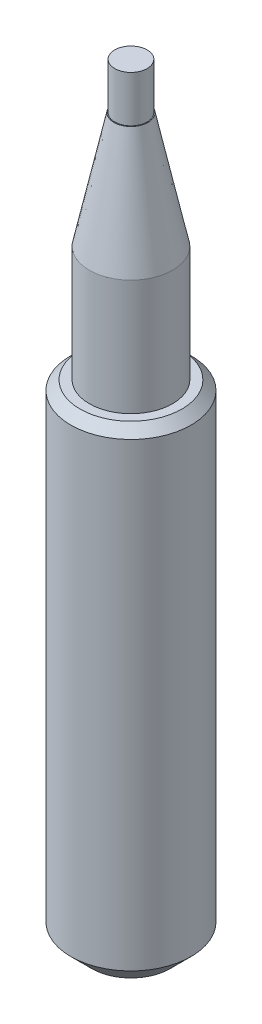
ISO-10303-21;
HEADER;
FILE_DESCRIPTION(('STEP AP214'),'2;1');
FILE_NAME('part.step','',(''),(''),'','','');
FILE_SCHEMA(('AUTOMOTIVE_DESIGN { 1 0 10303 214 1 1 1 1 }'));
ENDSEC;
DATA;
#1=APPLICATION_CONTEXT('core data for automotive mechanical design processes');
#2=APPLICATION_PROTOCOL_DEFINITION('international standard','automotive_design',2000,#1);
#3=PRODUCT_CONTEXT('',#1,'mechanical');
#4=PRODUCT('Part','Part','',(#3));
#5=PRODUCT_RELATED_PRODUCT_CATEGORY('part','',(#4));
#6=PRODUCT_DEFINITION_FORMATION('','',#4);
#7=PRODUCT_DEFINITION_CONTEXT('part definition',#1,'design');
#8=PRODUCT_DEFINITION('design','',#6,#7);
#9=PRODUCT_DEFINITION_SHAPE('','',#8);
#10=(LENGTH_UNIT() NAMED_UNIT(*) SI_UNIT(.MILLI.,.METRE.));
#11=(NAMED_UNIT(*) PLANE_ANGLE_UNIT() SI_UNIT($,.RADIAN.));
#12=(NAMED_UNIT(*) SI_UNIT($,.STERADIAN.) SOLID_ANGLE_UNIT());
#13=UNCERTAINTY_MEASURE_WITH_UNIT(LENGTH_MEASURE(1.E-05),#10,'distance_accuracy_value','');
#14=(GEOMETRIC_REPRESENTATION_CONTEXT(3) GLOBAL_UNCERTAINTY_ASSIGNED_CONTEXT((#13)) GLOBAL_UNIT_ASSIGNED_CONTEXT((#10,
#11,#12)) REPRESENTATION_CONTEXT('',''));
#15=CARTESIAN_POINT('',(0.,0.,0.));
#16=DIRECTION('',(0.,0.,1.));
#17=DIRECTION('',(1.,0.,0.));
#18=AXIS2_PLACEMENT_3D('',#15,#16,#17);
#19=CARTESIAN_POINT('',(0.,50.,0.));
#20=DIRECTION('',(0.,-1.,0.));
#21=DIRECTION('',(0.,0.,-1.));
#22=AXIS2_PLACEMENT_3D('',#19,#20,#21);
#23=CYLINDRICAL_SURFACE('',#22,9.);
#24=CARTESIAN_POINT('',(0.,24.9999999999998,0.));
#25=DIRECTION('',(0.,1.,0.));
#26=DIRECTION('',(0.,0.,1.));
#27=AXIS2_PLACEMENT_3D('',#24,#25,#26);
#28=CIRCLE('',#27,9.);
#29=CARTESIAN_POINT('',(0.,24.9999999999998,9.));
#30=VERTEX_POINT('',#29);
#31=EDGE_CURVE('E55',#30,#30,#28,.F.);
#32=ORIENTED_EDGE('',*,*,#31,.T.);
#33=EDGE_LOOP('',(#32));
#34=FACE_BOUND('',#33,.T.);
#35=CARTESIAN_POINT('',(0.,0.,0.));
#36=DIRECTION('',(0.,1.,0.));
#37=DIRECTION('',(0.,0.,1.));
#38=AXIS2_PLACEMENT_3D('',#35,#36,#37);
#39=CIRCLE('',#38,9.);
#40=CARTESIAN_POINT('',(0.,0.,9.));
#41=VERTEX_POINT('',#40);
#42=EDGE_CURVE('E155',#41,#41,#39,.T.);
#43=ORIENTED_EDGE('',*,*,#42,.T.);
#44=EDGE_LOOP('',(#43));
#45=FACE_BOUND('',#44,.T.);
#46=ADVANCED_FACE('F43',(#34,#45),#23,.T.);
#47=CARTESIAN_POINT('',(0.,50.,0.));
#48=DIRECTION('',(0.,1.,0.));
#49=DIRECTION('',(0.,0.,1.));
#50=AXIS2_PLACEMENT_3D('',#47,#48,#49);
#51=PLANE('',#50);
#52=CARTESIAN_POINT('',(0.,50.,0.));
#53=DIRECTION('',(0.,1.,0.));
#54=DIRECTION('',(0.,0.,1.));
#55=AXIS2_PLACEMENT_3D('',#52,#53,#54);
#56=CIRCLE('',#55,3.6860859582495);
#57=CARTESIAN_POINT('',(0.,50.,3.6860859582495));
#58=VERTEX_POINT('',#57);
#59=EDGE_CURVE('E59',#58,#58,#56,.T.);
#60=ORIENTED_EDGE('',*,*,#59,.T.);
#61=EDGE_LOOP('',(#60));
#62=FACE_BOUND('',#61,.T.);
#63=CARTESIAN_POINT('',(0.,50.,0.));
#64=DIRECTION('',(0.,1.,0.));
#65=DIRECTION('',(0.,0.,1.));
#66=AXIS2_PLACEMENT_3D('',#63,#64,#65);
#67=CIRCLE('',#66,3.5);
#68=CARTESIAN_POINT('',(0.,50.,3.5));
#69=VERTEX_POINT('',#68);
#70=EDGE_CURVE('E157',#69,#69,#67,.T.);
#71=ORIENTED_EDGE('',*,*,#70,.F.);
#72=EDGE_LOOP('',(#71));
#73=FACE_BOUND('',#72,.T.);
#74=ADVANCED_FACE('F144',(#62,#73),#51,.T.);
#75=CARTESIAN_POINT('',(0.,-106.,0.));
#76=DIRECTION('',(0.,1.,0.));
#77=DIRECTION('',(0.,0.,1.));
#78=AXIS2_PLACEMENT_3D('',#75,#76,#77);
#79=CYLINDRICAL_SURFACE('',#78,13.);
#80=CARTESIAN_POINT('',(0.,-1.99999999999999,0.));
#81=DIRECTION('',(0.,1.,0.));
#82=DIRECTION('',(0.,0.,1.));
#83=AXIS2_PLACEMENT_3D('',#80,#81,#82);
#84=CIRCLE('',#83,13.);
#85=CARTESIAN_POINT('',(0.,-1.99999999999999,13.));
#86=VERTEX_POINT('',#85);
#87=EDGE_CURVE('E10',#86,#86,#84,.F.);
#88=ORIENTED_EDGE('',*,*,#87,.T.);
#89=EDGE_LOOP('',(#88));
#90=FACE_BOUND('',#89,.T.);
#91=CARTESIAN_POINT('',(0.,-101.5,0.));
#92=DIRECTION('',(0.,1.,0.));
#93=DIRECTION('',(0.,0.,1.));
#94=AXIS2_PLACEMENT_3D('',#91,#92,#93);
#95=CIRCLE('',#94,13.);
#96=CARTESIAN_POINT('',(0.,-101.5,13.));
#97=VERTEX_POINT('',#96);
#98=EDGE_CURVE('E160',#97,#97,#95,.T.);
#99=ORIENTED_EDGE('',*,*,#98,.T.);
#100=EDGE_LOOP('',(#99));
#101=FACE_BOUND('',#100,.T.);
#102=ADVANCED_FACE('F138',(#90,#101),#79,.T.);
#103=CARTESIAN_POINT('',(0.,-106.,0.));
#104=DIRECTION('',(0.,1.,0.));
#105=DIRECTION('',(0.,0.,1.));
#106=AXIS2_PLACEMENT_3D('',#103,#104,#105);
#107=PLANE('',#106);
#108=CARTESIAN_POINT('',(0.,-106.,0.));
#109=DIRECTION('',(0.,1.,0.));
#110=DIRECTION('',(0.,0.,1.));
#111=AXIS2_PLACEMENT_3D('',#108,#109,#110);
#112=CIRCLE('',#111,8.50000000000001);
#113=CARTESIAN_POINT('',(0.,-106.,8.50000000000001));
#114=VERTEX_POINT('',#113);
#115=EDGE_CURVE('E167',#114,#114,#112,.F.);
#116=ORIENTED_EDGE('',*,*,#115,.T.);
#117=EDGE_LOOP('',(#116));
#118=FACE_BOUND('',#117,.T.);
#119=ADVANCED_FACE('F135',(#118),#107,.F.);
#120=CARTESIAN_POINT('',(0.,0.,0.));
#121=DIRECTION('',(0.,1.,0.));
#122=DIRECTION('',(0.,0.,1.));
#123=AXIS2_PLACEMENT_3D('',#120,#121,#122);
#124=PLANE('',#123);
#125=CARTESIAN_POINT('',(0.,0.,0.));
#126=DIRECTION('',(0.,1.,0.));
#127=DIRECTION('',(0.,0.,1.));
#128=AXIS2_PLACEMENT_3D('',#125,#126,#127);
#129=CIRCLE('',#128,11.);
#130=CARTESIAN_POINT('',(0.,0.,11.));
#131=VERTEX_POINT('',#130);
#132=EDGE_CURVE('E51',#131,#131,#129,.T.);
#133=ORIENTED_EDGE('',*,*,#132,.T.);
#134=EDGE_LOOP('',(#133));
#135=FACE_BOUND('',#134,.T.);
#136=ORIENTED_EDGE('',*,*,#42,.F.);
#137=EDGE_LOOP('',(#136));
#138=FACE_BOUND('',#137,.T.);
#139=ADVANCED_FACE('F133',(#135,#138),#124,.T.);
#140=CARTESIAN_POINT('',(0.,60.,0.));
#141=DIRECTION('',(0.,-1.,0.));
#142=DIRECTION('',(0.,0.,-1.));
#143=AXIS2_PLACEMENT_3D('',#140,#141,#142);
#144=CYLINDRICAL_SURFACE('',#143,3.5);
#145=CARTESIAN_POINT('',(0.,60.,0.));
#146=DIRECTION('',(0.,1.,0.));
#147=DIRECTION('',(0.,0.,1.));
#148=AXIS2_PLACEMENT_3D('',#145,#146,#147);
#149=CIRCLE('',#148,3.5);
#150=CARTESIAN_POINT('',(0.,60.,3.5));
#151=VERTEX_POINT('',#150);
#152=EDGE_CURVE('E70',#151,#151,#149,.T.);
#153=ORIENTED_EDGE('',*,*,#152,.F.);
#154=EDGE_LOOP('',(#153));
#155=FACE_BOUND('',#154,.T.);
#156=ORIENTED_EDGE('',*,*,#70,.T.);
#157=EDGE_LOOP('',(#156));
#158=FACE_BOUND('',#157,.T.);
#159=ADVANCED_FACE('F129',(#155,#158),#144,.T.);
#160=CARTESIAN_POINT('',(0.,60.,0.));
#161=DIRECTION('',(0.,1.,0.));
#162=DIRECTION('',(0.,0.,1.));
#163=AXIS2_PLACEMENT_3D('',#160,#161,#162);
#164=PLANE('',#163);
#165=ORIENTED_EDGE('',*,*,#152,.T.);
#166=EDGE_LOOP('',(#165));
#167=FACE_BOUND('',#166,.T.);
#168=ADVANCED_FACE('F126',(#167),#164,.T.);
#169=CARTESIAN_POINT('',(0.,-101.5,0.));
#170=DIRECTION('',(0.,1.,0.));
#171=DIRECTION('',(0.,0.,1.));
#172=AXIS2_PLACEMENT_3D('',#169,#170,#171);
#173=CONICAL_SURFACE('',#172,13.,0.785398163397447);
#174=CARTESIAN_POINT('',(-0.393021410673617,-105.411027913159,9.08047067976794));
#175=CARTESIAN_POINT('',(-0.358775831053087,-105.427130909163,9.06583478652538));
#176=CARTESIAN_POINT('',(-0.322999521141981,-105.441505244768,9.05280897905373));
#177=CARTESIAN_POINT('',(-0.248812672419158,-105.465971745856,9.03067574203376));
#178=CARTESIAN_POINT('',(-0.210401172549733,-105.476062339304,9.02156975095071));
#179=CARTESIAN_POINT('',(-0.1315461856168,-105.491246457491,9.00787904933069));
#180=CARTESIAN_POINT('',(-0.0910919454482393,-105.496309818835,9.00332162937981));
#181=CARTESIAN_POINT('',(-0.00963073737417806,-105.500870541686,8.99921624494616));
#182=CARTESIAN_POINT('',(0.0313758842693135,-105.500371241542,8.99966527591612));
#183=CARTESIAN_POINT('',(0.109857910107366,-105.494083809985,9.00532593954281));
#184=CARTESIAN_POINT('',(0.147386442127604,-105.488650583251,9.01021798254453));
#185=CARTESIAN_POINT('',(0.220786188505447,-105.473411800672,9.02396185351568));
#186=CARTESIAN_POINT('',(0.256656468063865,-105.463603811048,9.03281588563754));
#187=CARTESIAN_POINT('',(0.336419548476969,-105.436752281586,9.05711157795334));
#188=CARTESIAN_POINT('',(0.379519521319877,-105.418423732934,9.07372989262986));
#189=CARTESIAN_POINT('',(0.461126667118444,-105.376905463586,9.11152108390359));
#190=CARTESIAN_POINT('',(0.499625332718133,-105.353706950518,9.13270220014621));
#191=CARTESIAN_POINT('',(0.586278651535318,-105.293758230783,9.18768383235131));
#192=CARTESIAN_POINT('',(0.63217770038984,-105.255289268063,9.22315162619348));
#193=CARTESIAN_POINT('',(0.715179430609317,-105.173818435665,9.29879939016942));
#194=CARTESIAN_POINT('',(0.752265153348702,-105.130808053303,9.3389882261294));
#195=CARTESIAN_POINT('',(0.831742991981628,-105.023734261107,9.43978575638544));
#196=CARTESIAN_POINT('',(0.870125872358584,-104.958241350044,9.50203535872893));
#197=CARTESIAN_POINT('',(0.932021255671051,-104.824404552395,9.63063210280216));
#198=CARTESIAN_POINT('',(0.955518821900533,-104.756057875242,9.69698328724956));
#199=CARTESIAN_POINT('',(0.98863565718679,-104.616741470145,9.83369178827065));
#200=CARTESIAN_POINT('',(0.997915336423567,-104.545747863641,9.90410663448037));
#201=CARTESIAN_POINT('',(1.00145916016679,-104.404330674248,10.045877132335));
#202=CARTESIAN_POINT('',(0.995727478976816,-104.333906938353,10.1172325169482));
#203=CARTESIAN_POINT('',(0.969762876094511,-104.201502434859,10.2527532825838));
#204=CARTESIAN_POINT('',(0.950878545942826,-104.139331431761,10.3169888554229));
#205=CARTESIAN_POINT('',(0.899089786051067,-104.018392964014,10.4430224531994));
#206=CARTESIAN_POINT('',(0.866202838664413,-103.959621358775,10.504823413003));
#207=CARTESIAN_POINT('',(0.796184941942747,-103.862898975213,10.6073121802416));
#208=CARTESIAN_POINT('',(0.762619431397153,-103.823622030233,10.6491828917916));
#209=CARTESIAN_POINT('',(0.686926640799429,-103.74931526686,10.728792509616));
#210=CARTESIAN_POINT('',(0.644811332830668,-103.714279617802,10.7665370811574));
#211=CARTESIAN_POINT('',(0.562018918666693,-103.657123129884,10.8283672419193));
#212=CARTESIAN_POINT('',(0.523026398033017,-103.633851427061,10.8536372728428));
#213=CARTESIAN_POINT('',(0.439973576206153,-103.591950814615,10.8992549276368));
#214=CARTESIAN_POINT('',(0.395919162088173,-103.57331658983,10.9196081859859));
#215=CARTESIAN_POINT('',(0.310473209746651,-103.544166777283,10.9515050414718));
#216=CARTESIAN_POINT('',(0.269679925130151,-103.532851127075,10.9639137828377));
#217=CARTESIAN_POINT('',(0.185847411431572,-103.514989173267,10.9835191041871));
#218=CARTESIAN_POINT('',(0.142809371125071,-103.50844037218,10.9907184135258));
#219=CARTESIAN_POINT('',(0.0555400167198656,-103.5005250187,10.9994216658252));
#220=CARTESIAN_POINT('',(0.0113053266305891,-103.499175106453,11.0009073210014));
#221=CARTESIAN_POINT('',(-0.076812125861844,-103.501800436136,10.9980196059449));
#222=CARTESIAN_POINT('',(-0.120694875447921,-103.505775871129,10.9936460232946));
#223=CARTESIAN_POINT('',(-0.204539826341421,-103.51843779123,10.9797335989897));
#224=CARTESIAN_POINT('',(-0.244587632649738,-103.526871845335,10.9704715652972));
#225=CARTESIAN_POINT('',(-0.322258129390499,-103.547809399193,10.9475184979397));
#226=CARTESIAN_POINT('',(-0.359880372620785,-103.560313646813,10.9338266503325));
#227=CARTESIAN_POINT('',(-0.435265828800327,-103.590069153728,10.9013176106274));
#228=CARTESIAN_POINT('',(-0.472752722073525,-103.607640282603,10.8821565212863));
#229=CARTESIAN_POINT('',(-0.543754174139476,-103.646173764255,10.8402585663923));
#230=CARTESIAN_POINT('',(-0.577266182176492,-103.667138274442,10.81751942628));
#231=CARTESIAN_POINT('',(-0.656956237559921,-103.723700146536,10.7563737960686));
#232=CARTESIAN_POINT('',(-0.700378690441855,-103.761145645582,10.7160714212412));
#233=CARTESIAN_POINT('',(-0.777836113172551,-103.840559829892,10.6311037914674));
#234=CARTESIAN_POINT('',(-0.811847936703717,-103.882539320809,10.586428138703));
#235=CARTESIAN_POINT('',(-0.881053791523077,-103.984451764233,10.4786682235625));
#236=CARTESIAN_POINT('',(-0.912709769563759,-104.04563208514,10.414494036152));
#237=CARTESIAN_POINT('',(-0.961365314199783,-104.171242751045,10.283963253989));
#238=CARTESIAN_POINT('',(-0.978357883125861,-104.235674632245,10.2176056329224));
#239=CARTESIAN_POINT('',(-0.998907139456722,-104.367553722561,10.0831016634115));
#240=CARTESIAN_POINT('',(-1.0021787681108,-104.435035732018,10.0149466985299));
#241=CARTESIAN_POINT('',(-0.995040301193415,-104.57039742703,9.87962088031439));
#242=CARTESIAN_POINT('',(-0.98461337486246,-104.638277499587,9.81245134032121));
#243=CARTESIAN_POINT('',(-0.94720682602575,-104.784059543432,9.66966782540822));
#244=CARTESIAN_POINT('',(-0.917784558628886,-104.861771498502,9.59448432499464));
#245=CARTESIAN_POINT('',(-0.839229288864256,-105.012810063665,9.45005643042834));
#246=CARTESIAN_POINT('',(-0.790134207771608,-105.086144800587,9.38080091941179));
#247=CARTESIAN_POINT('',(-0.696135473322457,-105.193605795249,9.28037159737517));
#248=CARTESIAN_POINT('',(-0.658626261801346,-105.230956987353,9.24569565223369));
#249=CARTESIAN_POINT('',(-0.576191649950029,-105.301000048684,9.18101961706271));
#250=CARTESIAN_POINT('',(-0.531302371046203,-105.333713233667,9.15099807213028));
#251=CARTESIAN_POINT('',(-0.454057830122888,-105.380301297889,9.10843007601075));
#252=CARTESIAN_POINT('',(-0.42417293308814,-105.396379808309,9.09378423326753));
#253=CARTESIAN_POINT('',(-0.393021410673617,-105.411027913159,9.08047067976794));
#254=B_SPLINE_CURVE_WITH_KNOTS('',3,(#174,#175,#176,#177,#178,#179,#180,#181,#182,#183,#184,
#185,#186,#187,#188,#189,#190,#191,#192,#193,#194,#195,#196,#197,#198,#199,#200,#201,#202,#203,
#204,#205,#206,#207,#208,#209,#210,#211,#212,#213,#214,#215,#216,#217,#218,#219,#220,#221,#222,
#223,#224,#225,#226,#227,#228,#229,#230,#231,#232,#233,#234,#235,#236,#237,#238,#239,#240,#241,
#242,#243,#244,#245,#246,#247,#248,#249,#250,#251,#252,#253),.UNSPECIFIED.,.T.,.F.,(4,2,2,2,2,2,
2,2,2,2,2,2,2,2,2,2,2,2,2,2,2,2,2,2,2,2,2,2,2,2,2,2,2,2,2,2,2,2,2,4),(0.,0.121638652691394,
0.243321905462089,0.365730923808938,0.488066484155239,0.602244128848482,0.716485372509629,
0.864754377865921,1.01329341061433,1.22095341854166,1.42900982838411,1.72195997424973,
2.01520361796852,2.3153477504722,2.61540842886794,2.88852057407812,3.16129273236648,
3.36014284522863,3.55871641004181,3.71404054929338,3.86918583810879,4.00096459730924,
4.13267426414575,4.26480514707709,4.39694082033841,4.5222903959459,4.64766301660826,
4.78401758996283,4.92045919645634,5.12954245151855,5.33913548504909,5.62006877231013,
5.90113605247539,6.18801456427591,6.475245879836,6.80976793772868,7.14364824986228,
7.33291882032998,7.52128918121323,7.6319378914344),.UNSPECIFIED.);
#255=CARTESIAN_POINT('',(-0.393021410673617,-105.411027913159,9.08047067976794));
#256=VERTEX_POINT('',#255);
#257=EDGE_CURVE('E62',#256,#256,#254,.T.);
#258=ORIENTED_EDGE('',*,*,#257,.F.);
#259=EDGE_LOOP('',(#258));
#260=FACE_BOUND('',#259,.T.);
#261=CARTESIAN_POINT('',(9.08047067976794,-105.411027913159,-0.39302141067365));
#262=CARTESIAN_POINT('',(9.10342146559309,-105.385776976286,-0.446709550160843));
#263=CARTESIAN_POINT('',(9.13039252056559,-105.356209942741,-0.496761212484952));
#264=CARTESIAN_POINT('',(9.19008502477693,-105.291158041647,-0.589150681226498));
#265=CARTESIAN_POINT('',(9.22283881790075,-105.255639948945,-0.631442217722138));
#266=CARTESIAN_POINT('',(9.30359501332132,-105.168636894371,-0.720918431144026));
#267=CARTESIAN_POINT('',(9.35311374598943,-105.115690513565,-0.76530263483165));
#268=CARTESIAN_POINT('',(9.4567128695154,-105.005933904013,-0.842020393342623));
#269=CARTESIAN_POINT('',(9.51079439427021,-104.949122715509,-0.874350941837525));
#270=CARTESIAN_POINT('',(9.63812679687593,-104.816607934213,-0.935616643285285));
#271=CARTESIAN_POINT('',(9.71240384888256,-104.740185702387,-0.960876049472602));
#272=CARTESIAN_POINT('',(9.86380694825497,-104.586267797711,-0.993709000675275));
#273=CARTESIAN_POINT('',(9.94093679622287,-104.508770785646,-1.00125802096911));
#274=CARTESIAN_POINT('',(10.0964813959425,-104.35427989284,-0.998391999960935));
#275=CARTESIAN_POINT('',(10.1749013538377,-104.277293264281,-0.987851605284023));
#276=CARTESIAN_POINT('',(10.3299562307482,-104.126728889653,-0.94737935823618));
#277=CARTESIAN_POINT('',(10.4065947358264,-104.053143934444,-0.917490738955875));
#278=CARTESIAN_POINT('',(10.5283669497164,-103.937356825758,-0.850766276324799));
#279=CARTESIAN_POINT('',(10.5750796079067,-103.89323897183,-0.82009775050779));
#280=CARTESIAN_POINT('',(10.664772125377,-103.80901304009,-0.749223026743194));
#281=CARTESIAN_POINT('',(10.7077574152326,-103.768899115431,-0.70903103410073));
#282=CARTESIAN_POINT('',(10.7790498524719,-103.702692787255,-0.628721888336149));
#283=CARTESIAN_POINT('',(10.8084987742661,-103.675463107796,-0.590562012627116));
#284=CARTESIAN_POINT('',(10.8625977582494,-103.625600021851,-0.508272095817515));
#285=CARTESIAN_POINT('',(10.887253599992,-103.602961078362,-0.46414935506908));
#286=CARTESIAN_POINT('',(10.9264777543095,-103.567030556672,-0.378738701927137));
#287=CARTESIAN_POINT('',(10.9420573830142,-103.552795448153,-0.338315470633147));
#288=CARTESIAN_POINT('',(10.9680624359454,-103.52906610998,-0.254510205258925));
#289=CARTESIAN_POINT('',(10.9784908651577,-103.519569116284,-0.211129913048932));
#290=CARTESIAN_POINT('',(10.9935178921698,-103.505892201221,-0.122308980770759));
#291=CARTESIAN_POINT('',(10.9980874521189,-103.501738763352,-0.0768592256225087));
#292=CARTESIAN_POINT('',(11.0009369918152,-103.499148123682,0.0143990522459966));
#293=CARTESIAN_POINT('',(10.9992182681432,-103.500709743492,0.0602074990641082));
#294=CARTESIAN_POINT('',(10.9900345724775,-103.509062562108,0.146883117401748));
#295=CARTESIAN_POINT('',(10.983053985685,-103.515412946191,0.187846756279075));
#296=CARTESIAN_POINT('',(10.9643672906174,-103.532437932328,0.267730210758732));
#297=CARTESIAN_POINT('',(10.9526606317344,-103.543113038233,0.306649787621735));
#298=CARTESIAN_POINT('',(10.9244205104662,-103.568916612849,0.383691422711408));
#299=CARTESIAN_POINT('',(10.907663605767,-103.584251591908,0.421661191954997));
#300=CARTESIAN_POINT('',(10.8704153433644,-103.618428435996,0.493999910400613));
#301=CARTESIAN_POINT('',(10.8499218641878,-103.637272293353,0.528366796486521));
#302=CARTESIAN_POINT('',(10.7951232856112,-103.687813611622,0.609261114289618));
#303=CARTESIAN_POINT('',(10.7589836327435,-103.721273599012,0.653452445821498));
#304=CARTESIAN_POINT('',(10.6821352384064,-103.792806479296,0.733333930866002));
#305=CARTESIAN_POINT('',(10.6414160272134,-103.83088995881,0.769003997256744));
#306=CARTESIAN_POINT('',(10.5423577610912,-103.924083959938,0.843141323662138));
#307=CARTESIAN_POINT('',(10.48279923746,-103.980524643129,0.878301460224758));
#308=CARTESIAN_POINT('',(10.3609358993967,-104.097013612197,0.935013467753706));
#309=CARTESIAN_POINT('',(10.2986292967699,-104.157064256609,0.956556333829014));
#310=CARTESIAN_POINT('',(10.1715475737543,-104.280662601904,0.987392192824112));
#311=CARTESIAN_POINT('',(10.1067488064021,-104.344259252194,0.996386750135945));
#312=CARTESIAN_POINT('',(9.97746986161161,-104.47236276702,1.00183926800034));
#313=CARTESIAN_POINT('',(9.91298999983965,-104.536870355635,0.998286623135406));
#314=CARTESIAN_POINT('',(9.77238046140884,-104.678918972169,0.976856125186505));
#315=CARTESIAN_POINT('',(9.69659977497531,-104.756396013404,0.956167229662883));
#316=CARTESIAN_POINT('',(9.54954594697159,-104.908510788717,0.896318595290099));
#317=CARTESIAN_POINT('',(9.47826688613175,-104.983152197662,0.857183710079699));
#318=CARTESIAN_POINT('',(9.36918929729225,-105.098630112918,0.777644928779365));
#319=CARTESIAN_POINT('',(9.32899810048956,-105.1414930243,0.743429927176388));
#320=CARTESIAN_POINT('',(9.2527417841156,-105.223336050364,0.666725476866016));
#321=CARTESIAN_POINT('',(9.21666975407033,-105.262322653443,0.624250219461234));
#322=CARTESIAN_POINT('',(9.15862638063706,-105.325400984024,0.542172074986832));
#323=CARTESIAN_POINT('',(9.13537799154805,-105.350787226535,0.504475703434498));
#324=CARTESIAN_POINT('',(9.0932564502566,-105.396942293423,0.424106053351568));
#325=CARTESIAN_POINT('',(9.07437728668033,-105.417717460288,0.381439735746385));
#326=CARTESIAN_POINT('',(9.04546312159642,-105.44961512836,0.300534755753679));
#327=CARTESIAN_POINT('',(9.03441682215516,-105.461834692584,0.263094784366449));
#328=CARTESIAN_POINT('',(9.01665546449527,-105.48150749199,0.185994043766786));
#329=CARTESIAN_POINT('',(9.00993658300781,-105.488964934452,0.14633526863303));
#330=CARTESIAN_POINT('',(9.00132942398328,-105.49852162922,0.0656485276644967));
#331=CARTESIAN_POINT('',(8.99946446937344,-105.500595011221,0.0246149072443151));
#332=CARTESIAN_POINT('',(9.00080235137254,-105.49910852373,-0.0572831118023424));
#333=CARTESIAN_POINT('',(9.00400709753198,-105.495546531622,-0.0981474408503521));
#334=CARTESIAN_POINT('',(9.01477996617491,-105.483591029948,-0.175355305600134));
#335=CARTESIAN_POINT('',(9.02200505637291,-105.475577430683,-0.211808776880322));
#336=CARTESIAN_POINT('',(9.04007219950635,-105.455579489625,-0.282615576100747));
#337=CARTESIAN_POINT('',(9.05091016040719,-105.443599640217,-0.31697122823467));
#338=CARTESIAN_POINT('',(9.06871060790246,-105.423973954904,-0.364614680066854));
#339=CARTESIAN_POINT('',(9.07445242369189,-105.417649324967,-0.378943070431069));
#340=CARTESIAN_POINT('',(9.08047067976794,-105.411027913159,-0.39302141067365));
#341=B_SPLINE_CURVE_WITH_KNOTS('',3,(#261,#262,#263,#264,#265,#266,#267,#268,#269,#270,#271,
#272,#273,#274,#275,#276,#277,#278,#279,#280,#281,#282,#283,#284,#285,#286,#287,#288,#289,#290,
#291,#292,#293,#294,#295,#296,#297,#298,#299,#300,#301,#302,#303,#304,#305,#306,#307,#308,#309,
#310,#311,#312,#313,#314,#315,#316,#317,#318,#319,#320,#321,#322,#323,#324,#325,#326,#327,#328,
#329,#330,#331,#332,#333,#334,#335,#336,#337,#338,#339,#340),.UNSPECIFIED.,.T.,.F.,(4,2,2,2,2,2,
2,2,2,2,2,2,2,2,2,2,2,2,2,2,2,2,2,2,2,2,2,2,2,2,2,2,2,2,2,2,2,2,2,4),(0.,0.190793811833146,
0.382690680831501,0.636301918923639,0.889976368499783,1.21689605397271,1.54426817983697,
1.87391805148233,2.20283386003778,2.41575316876054,2.62835686214061,2.79384552334816,
2.95913338145623,3.09537142629905,3.23152990165052,3.36836063249199,3.50516315180248,
3.63071073671594,3.75627295268891,3.88850768280136,4.02081772546815,4.218224936704,
4.4160930015105,4.6824656650577,4.94901429296534,5.22180000927533,5.49481635058689,
5.82430357065109,6.15334811187537,6.35676719286321,6.55983983446419,6.71247836543402,
6.86490562423769,6.98711958985089,7.10922543090925,7.23191691167569,7.35465461634744,
7.46824396042444,7.58170508482099,7.63173587793139),.UNSPECIFIED.);
#342=CARTESIAN_POINT('',(9.08047067976794,-105.411027913159,-0.39302141067365));
#343=VERTEX_POINT('',#342);
#344=EDGE_CURVE('E71',#343,#343,#341,.T.);
#345=ORIENTED_EDGE('',*,*,#344,.F.);
#346=EDGE_LOOP('',(#345));
#347=FACE_BOUND('',#346,.T.);
#348=CARTESIAN_POINT('',(-0.393021410673683,-105.411027913159,-9.08047067976794));
#349=CARTESIAN_POINT('',(-0.446709550160875,-105.385776976286,-9.10342146559309));
#350=CARTESIAN_POINT('',(-0.496761212484985,-105.356209942741,-9.13039252056559));
#351=CARTESIAN_POINT('',(-0.58915068122653,-105.291158041647,-9.19008502477693));
#352=CARTESIAN_POINT('',(-0.63144221772217,-105.255639948945,-9.22283881790075));
#353=CARTESIAN_POINT('',(-0.720918431144058,-105.168636894371,-9.30359501332132));
#354=CARTESIAN_POINT('',(-0.765302634831682,-105.115690513565,-9.35311374598943));
#355=CARTESIAN_POINT('',(-0.842020393342654,-105.005933904013,-9.4567128695154));
#356=CARTESIAN_POINT('',(-0.874350941837556,-104.949122715509,-9.5107943942702));
#357=CARTESIAN_POINT('',(-0.935616643285319,-104.816607934213,-9.63812679687592));
#358=CARTESIAN_POINT('',(-0.960876049472638,-104.740185702387,-9.71240384888256));
#359=CARTESIAN_POINT('',(-0.99370900067531,-104.586267797711,-9.86380694825498));
#360=CARTESIAN_POINT('',(-1.00125802096914,-104.508770785646,-9.94093679622287));
#361=CARTESIAN_POINT('',(-0.99839199996097,-104.35427989284,-10.0964813959425));
#362=CARTESIAN_POINT('',(-0.987851605284059,-104.277293264281,-10.1749013538377));
#363=CARTESIAN_POINT('',(-0.947379358236218,-104.126728889653,-10.3299562307482));
#364=CARTESIAN_POINT('',(-0.917490738955913,-104.053143934444,-10.4065947358264));
#365=CARTESIAN_POINT('',(-0.850766276324834,-103.937356825758,-10.5283669497164));
#366=CARTESIAN_POINT('',(-0.820097750507823,-103.89323897183,-10.5750796079067));
#367=CARTESIAN_POINT('',(-0.749223026743227,-103.80901304009,-10.664772125377));
#368=CARTESIAN_POINT('',(-0.709031034100767,-103.768899115431,-10.7077574152326));
#369=CARTESIAN_POINT('',(-0.628721888336188,-103.702692787255,-10.7790498524719));
#370=CARTESIAN_POINT('',(-0.590562012627155,-103.675463107796,-10.8084987742661));
#371=CARTESIAN_POINT('',(-0.508272095817554,-103.625600021851,-10.8625977582494));
#372=CARTESIAN_POINT('',(-0.464149355069118,-103.602961078362,-10.887253599992));
#373=CARTESIAN_POINT('',(-0.378738701927176,-103.567030556672,-10.9264777543095));
#374=CARTESIAN_POINT('',(-0.338315470633187,-103.552795448153,-10.9420573830142));
#375=CARTESIAN_POINT('',(-0.254510205258966,-103.52906610998,-10.9680624359453));
#376=CARTESIAN_POINT('',(-0.211129913048973,-103.519569116284,-10.9784908651577));
#377=CARTESIAN_POINT('',(-0.1223089807708,-103.505892201221,-10.9935178921698));
#378=CARTESIAN_POINT('',(-0.0768592256225501,-103.501738763352,-10.9980874521189));
#379=CARTESIAN_POINT('',(0.0143990522459555,-103.499148123682,-11.0009369918152));
#380=CARTESIAN_POINT('',(0.0602074990640672,-103.500709743492,-10.9992182681432));
#381=CARTESIAN_POINT('',(0.146883117401707,-103.509062562108,-10.9900345724775));
#382=CARTESIAN_POINT('',(0.187846756279033,-103.515412946191,-10.983053985685));
#383=CARTESIAN_POINT('',(0.26773021075869,-103.532437932328,-10.9643672906174));
#384=CARTESIAN_POINT('',(0.306649787621693,-103.543113038233,-10.9526606317344));
#385=CARTESIAN_POINT('',(0.383691422711362,-103.568916612849,-10.9244205104662));
#386=CARTESIAN_POINT('',(0.42166119195495,-103.584251591908,-10.907663605767));
#387=CARTESIAN_POINT('',(0.493999910400566,-103.618428435996,-10.8704153433644));
#388=CARTESIAN_POINT('',(0.528366796486479,-103.637272293353,-10.8499218641878));
#389=CARTESIAN_POINT('',(0.609261114289579,-103.687813611622,-10.7951232856112));
#390=CARTESIAN_POINT('',(0.653452445821459,-103.721273599012,-10.7589836327435));
#391=CARTESIAN_POINT('',(0.733333930865963,-103.792806479296,-10.6821352384064));
#392=CARTESIAN_POINT('',(0.769003997256706,-103.83088995881,-10.6414160272134));
#393=CARTESIAN_POINT('',(0.8431413236621,-103.924083959938,-10.5423577610912));
#394=CARTESIAN_POINT('',(0.878301460224719,-103.980524643129,-10.48279923746));
#395=CARTESIAN_POINT('',(0.935013467753666,-104.097013612197,-10.3609358993967));
#396=CARTESIAN_POINT('',(0.956556333828974,-104.157064256609,-10.29862929677));
#397=CARTESIAN_POINT('',(0.987392192824075,-104.280662601904,-10.1715475737543));
#398=CARTESIAN_POINT('',(0.996386750135909,-104.344259252194,-10.1067488064021));
#399=CARTESIAN_POINT('',(1.00183926800031,-104.47236276702,-9.97746986161162));
#400=CARTESIAN_POINT('',(0.998286623135371,-104.536870355635,-9.91298999983966));
#401=CARTESIAN_POINT('',(0.976856125186473,-104.678918972169,-9.77238046140885));
#402=CARTESIAN_POINT('',(0.956167229662853,-104.756396013404,-9.69659977497533));
#403=CARTESIAN_POINT('',(0.896318595290072,-104.908510788717,-9.5495459469716));
#404=CARTESIAN_POINT('',(0.857183710079672,-104.983152197662,-9.47826688613176));
#405=CARTESIAN_POINT('',(0.777644928779339,-105.098630112918,-9.36918929729226));
#406=CARTESIAN_POINT('',(0.743429927176361,-105.1414930243,-9.32899810048957));
#407=CARTESIAN_POINT('',(0.666725476865991,-105.223336050364,-9.25274178411561));
#408=CARTESIAN_POINT('',(0.624250219461211,-105.262322653443,-9.21666975407034));
#409=CARTESIAN_POINT('',(0.542172074986805,-105.325400984024,-9.15862638063707));
#410=CARTESIAN_POINT('',(0.504475703434468,-105.350787226535,-9.13537799154806));
#411=CARTESIAN_POINT('',(0.424106053351539,-105.396942293423,-9.09325645025661));
#412=CARTESIAN_POINT('',(0.381439735746359,-105.417717460288,-9.07437728668033));
#413=CARTESIAN_POINT('',(0.300534755753654,-105.44961512836,-9.04546312159643));
#414=CARTESIAN_POINT('',(0.263094784366423,-105.461834692584,-9.03441682215516));
#415=CARTESIAN_POINT('',(0.185994043766759,-105.48150749199,-9.01665546449527));
#416=CARTESIAN_POINT('',(0.146335268633003,-105.488964934452,-9.00993658300781));
#417=CARTESIAN_POINT('',(0.0656485276644696,-105.49852162922,-9.00132942398328));
#418=CARTESIAN_POINT('',(0.0246149072442879,-105.500595011221,-8.99946446937344));
#419=CARTESIAN_POINT('',(-0.0572831118023697,-105.49910852373,-9.00080235137254));
#420=CARTESIAN_POINT('',(-0.0981474408503793,-105.495546531622,-9.00400709753198));
#421=CARTESIAN_POINT('',(-0.175355305600161,-105.483591029948,-9.01477996617491));
#422=CARTESIAN_POINT('',(-0.21180877688035,-105.475577430683,-9.02200505637291));
#423=CARTESIAN_POINT('',(-0.282615576100775,-105.455579489625,-9.04007219950634));
#424=CARTESIAN_POINT('',(-0.316971228234697,-105.443599640217,-9.05091016040718));
#425=CARTESIAN_POINT('',(-0.364614680066884,-105.423973954904,-9.06871060790246));
#426=CARTESIAN_POINT('',(-0.3789430704311,-105.417649324967,-9.07445242369188));
#427=CARTESIAN_POINT('',(-0.393021410673683,-105.411027913159,-9.08047067976794));
#428=B_SPLINE_CURVE_WITH_KNOTS('',3,(#348,#349,#350,#351,#352,#353,#354,#355,#356,#357,#358,
#359,#360,#361,#362,#363,#364,#365,#366,#367,#368,#369,#370,#371,#372,#373,#374,#375,#376,#377,
#378,#379,#380,#381,#382,#383,#384,#385,#386,#387,#388,#389,#390,#391,#392,#393,#394,#395,#396,
#397,#398,#399,#400,#401,#402,#403,#404,#405,#406,#407,#408,#409,#410,#411,#412,#413,#414,#415,
#416,#417,#418,#419,#420,#421,#422,#423,#424,#425,#426,#427),.UNSPECIFIED.,.T.,.F.,(4,2,2,2,2,2,
2,2,2,2,2,2,2,2,2,2,2,2,2,2,2,2,2,2,2,2,2,2,2,2,2,2,2,2,2,2,2,2,2,4),(0.,0.190793811833146,
0.3826906808315,0.636301918923638,0.88997636849978,1.21689605397273,1.54426817983697,
1.87391805148233,2.20283386003778,2.41575316876055,2.62835686214061,2.79384552334816,
2.95913338145623,3.09537142629904,3.23152990165052,3.36836063249199,3.50516315180248,
3.63071073671594,3.75627295268891,3.88850768280134,4.02081772546815,4.218224936704,
4.4160930015105,4.68246566505769,4.94901429296532,5.22180000927533,5.49481635058689,
5.82430357065108,6.15334811187536,6.3567671928632,6.55983983446419,6.71247836543401,
6.86490562423768,6.98711958985089,7.10922543090925,7.23191691167569,7.35465461634744,
7.46824396042443,7.58170508482098,7.63173587793139),.UNSPECIFIED.);
#429=CARTESIAN_POINT('',(-0.393021410673683,-105.411027913159,-9.08047067976794));
#430=VERTEX_POINT('',#429);
#431=EDGE_CURVE('E104',#430,#430,#428,.T.);
#432=ORIENTED_EDGE('',*,*,#431,.F.);
#433=EDGE_LOOP('',(#432));
#434=FACE_BOUND('',#433,.T.);
#435=CARTESIAN_POINT('',(-9.08047067976794,-105.411027913159,-0.393021410673515));
#436=CARTESIAN_POINT('',(-9.06583478652538,-105.427130909163,-0.358775831052985));
#437=CARTESIAN_POINT('',(-9.05280897905373,-105.441505244768,-0.32299952114188));
#438=CARTESIAN_POINT('',(-9.03067574203375,-105.465971745856,-0.248812672419057));
#439=CARTESIAN_POINT('',(-9.02156975095071,-105.476062339304,-0.210401172549631));
#440=CARTESIAN_POINT('',(-9.00787904933069,-105.491246457491,-0.131546185616697));
#441=CARTESIAN_POINT('',(-9.00332162937981,-105.496309818835,-0.0910919454481359));
#442=CARTESIAN_POINT('',(-8.99921624494616,-105.500870541686,-0.00963073737407388));
#443=CARTESIAN_POINT('',(-8.99966527591612,-105.500371241542,0.0313758842694176));
#444=CARTESIAN_POINT('',(-9.00532593954281,-105.494083809985,0.109857910107471));
#445=CARTESIAN_POINT('',(-9.01021798254453,-105.488650583251,0.14738644212771));
#446=CARTESIAN_POINT('',(-9.02396185351568,-105.473411800672,0.220786188505552));
#447=CARTESIAN_POINT('',(-9.03281588563754,-105.463603811048,0.256656468063971));
#448=CARTESIAN_POINT('',(-9.05711157795334,-105.436752281586,0.336419548477076));
#449=CARTESIAN_POINT('',(-9.07372989262986,-105.418423732934,0.379519521319986));
#450=CARTESIAN_POINT('',(-9.11152108390359,-105.376905463586,0.461126667118555));
#451=CARTESIAN_POINT('',(-9.13270220014621,-105.353706950518,0.499625332718245));
#452=CARTESIAN_POINT('',(-9.18768383235132,-105.293758230783,0.586278651535432));
#453=CARTESIAN_POINT('',(-9.22315162619349,-105.255289268063,0.632177700389959));
#454=CARTESIAN_POINT('',(-9.29879939016944,-105.173818435665,0.715179430609438));
#455=CARTESIAN_POINT('',(-9.33898822612941,-105.130808053303,0.752265153348821));
#456=CARTESIAN_POINT('',(-9.43978575638545,-105.023734261107,0.831742991981743));
#457=CARTESIAN_POINT('',(-9.50203535872895,-104.958241350044,0.870125872358699));
#458=CARTESIAN_POINT('',(-9.63063210280219,-104.824404552395,0.932021255671166));
#459=CARTESIAN_POINT('',(-9.69698328724959,-104.756057875242,0.955518821900647));
#460=CARTESIAN_POINT('',(-9.83369178827069,-104.616741470145,0.988635657186901));
#461=CARTESIAN_POINT('',(-9.90410663448041,-104.545747863641,0.997915336423676));
#462=CARTESIAN_POINT('',(-10.045877132335,-104.404330674248,1.00145916016689));
#463=CARTESIAN_POINT('',(-10.1172325169482,-104.333906938353,0.995727478976915));
#464=CARTESIAN_POINT('',(-10.2527532825839,-104.201502434859,0.969762876094607));
#465=CARTESIAN_POINT('',(-10.3169888554229,-104.139331431761,0.95087854594292));
#466=CARTESIAN_POINT('',(-10.4430224531995,-104.018392964014,0.899089786051158));
#467=CARTESIAN_POINT('',(-10.504823413003,-103.959621358775,0.866202838664502));
#468=CARTESIAN_POINT('',(-10.6073121802416,-103.862898975213,0.796184941942837));
#469=CARTESIAN_POINT('',(-10.6491828917916,-103.823622030233,0.762619431397244));
#470=CARTESIAN_POINT('',(-10.728792509616,-103.74931526686,0.686926640799518));
#471=CARTESIAN_POINT('',(-10.7665370811574,-103.714279617802,0.644811332830752));
#472=CARTESIAN_POINT('',(-10.8283672419193,-103.657123129884,0.562018918666774));
#473=CARTESIAN_POINT('',(-10.8536372728428,-103.633851427061,0.523026398033098));
#474=CARTESIAN_POINT('',(-10.8992549276368,-103.591950814615,0.439973576206235));
#475=CARTESIAN_POINT('',(-10.9196081859859,-103.57331658983,0.395919162088256));
#476=CARTESIAN_POINT('',(-10.9515050414719,-103.544166777283,0.310473209746736));
#477=CARTESIAN_POINT('',(-10.9639137828377,-103.532851127075,0.269679925130235));
#478=CARTESIAN_POINT('',(-10.9835191041871,-103.514989173267,0.185847411431655));
#479=CARTESIAN_POINT('',(-10.9907184135258,-103.50844037218,0.142809371125153));
#480=CARTESIAN_POINT('',(-10.9994216658252,-103.5005250187,0.0555400167199457));
#481=CARTESIAN_POINT('',(-11.0009073210014,-103.499175106453,0.0113053266306682));
#482=CARTESIAN_POINT('',(-10.9980196059449,-103.501800436136,-0.0768121258617657));
#483=CARTESIAN_POINT('',(-10.9936460232946,-103.505775871129,-0.120694875447843));
#484=CARTESIAN_POINT('',(-10.9797335989897,-103.51843779123,-0.204539826341342));
#485=CARTESIAN_POINT('',(-10.9704715652972,-103.526871845335,-0.244587632649659));
#486=CARTESIAN_POINT('',(-10.9475184979397,-103.547809399193,-0.322258129390419));
#487=CARTESIAN_POINT('',(-10.9338266503325,-103.560313646813,-0.359880372620703));
#488=CARTESIAN_POINT('',(-10.9013176106274,-103.590069153728,-0.435265828800246));
#489=CARTESIAN_POINT('',(-10.8821565212863,-103.607640282603,-0.472752722073448));
#490=CARTESIAN_POINT('',(-10.8402585663923,-103.646173764255,-0.5437541741394));
#491=CARTESIAN_POINT('',(-10.81751942628,-103.667138274442,-0.577266182176415));
#492=CARTESIAN_POINT('',(-10.7563737960685,-103.723700146536,-0.65695623755984));
#493=CARTESIAN_POINT('',(-10.7160714212412,-103.761145645582,-0.700378690441775));
#494=CARTESIAN_POINT('',(-10.6311037914674,-103.840559829892,-0.777836113172471));
#495=CARTESIAN_POINT('',(-10.5864281387029,-103.882539320809,-0.811847936703636));
#496=CARTESIAN_POINT('',(-10.4786682235624,-103.984451764233,-0.881053791522993));
#497=CARTESIAN_POINT('',(-10.4144940361519,-104.04563208514,-0.912709769563674));
#498=CARTESIAN_POINT('',(-10.283963253989,-104.171242751045,-0.961365314199694));
#499=CARTESIAN_POINT('',(-10.2176056329224,-104.235674632245,-0.978357883125769));
#500=CARTESIAN_POINT('',(-10.0831016634115,-104.367553722561,-0.998907139456622));
#501=CARTESIAN_POINT('',(-10.0149466985299,-104.435035732019,-1.0021787681107));
#502=CARTESIAN_POINT('',(-9.87962088031432,-104.57039742703,-0.995040301193304));
#503=CARTESIAN_POINT('',(-9.81245134032115,-104.638277499587,-0.984613374862344));
#504=CARTESIAN_POINT('',(-9.66966782540815,-104.784059543432,-0.947206826025625));
#505=CARTESIAN_POINT('',(-9.59448432499459,-104.861771498502,-0.917784558628757));
#506=CARTESIAN_POINT('',(-9.45005643042828,-105.012810063665,-0.839229288864114));
#507=CARTESIAN_POINT('',(-9.38080091941173,-105.086144800587,-0.790134207771458));
#508=CARTESIAN_POINT('',(-9.28037159737512,-105.19360579525,-0.696135473322297));
#509=CARTESIAN_POINT('',(-9.24569565223364,-105.230956987353,-0.658626261801182));
#510=CARTESIAN_POINT('',(-9.18101961706266,-105.301000048684,-0.576191649949862));
#511=CARTESIAN_POINT('',(-9.15099807213024,-105.333713233667,-0.531302371046038));
#512=CARTESIAN_POINT('',(-9.10843007601073,-105.380301297889,-0.454057830122744));
#513=CARTESIAN_POINT('',(-9.09378423326752,-105.396379808309,-0.424172933088015));
#514=CARTESIAN_POINT('',(-9.08047067976794,-105.411027913159,-0.393021410673515));
#515=B_SPLINE_CURVE_WITH_KNOTS('',3,(#435,#436,#437,#438,#439,#440,#441,#442,#443,#444,#445,
#446,#447,#448,#449,#450,#451,#452,#453,#454,#455,#456,#457,#458,#459,#460,#461,#462,#463,#464,
#465,#466,#467,#468,#469,#470,#471,#472,#473,#474,#475,#476,#477,#478,#479,#480,#481,#482,#483,
#484,#485,#486,#487,#488,#489,#490,#491,#492,#493,#494,#495,#496,#497,#498,#499,#500,#501,#502,
#503,#504,#505,#506,#507,#508,#509,#510,#511,#512,#513,#514),.UNSPECIFIED.,.T.,.F.,(4,2,2,2,2,2,
2,2,2,2,2,2,2,2,2,2,2,2,2,2,2,2,2,2,2,2,2,2,2,2,2,2,2,2,2,2,2,2,2,4),(0.,0.121638652691393,
0.243321905462089,0.36573092380894,0.488066484155241,0.602244128848486,0.716485372509634,
0.864754377865928,1.01329341061435,1.22095341854169,1.42900982838415,1.72195997424976,
2.01520361796857,2.31534775047228,2.615408428868,2.88852057407817,3.16129273236652,
3.36014284522867,3.55871641004184,3.71404054929342,3.86918583810881,4.00096459730927,
4.13267426414578,4.26480514707712,4.39694082033844,4.52229039594593,4.64766301660829,
4.78401758996286,4.92045919645639,5.12954245151859,5.33913548504915,5.6200687723102,
5.90113605247548,6.188014564276,6.47524587983609,6.80976793772879,7.14364824986238,
7.33291882033009,7.52128918121331,7.6319378914344),.UNSPECIFIED.);
#516=CARTESIAN_POINT('',(-9.08047067976794,-105.411027913159,-0.393021410673515));
#517=VERTEX_POINT('',#516);
#518=EDGE_CURVE('E110',#517,#517,#515,.T.);
#519=ORIENTED_EDGE('',*,*,#518,.F.);
#520=EDGE_LOOP('',(#519));
#521=FACE_BOUND('',#520,.T.);
#522=ORIENTED_EDGE('',*,*,#115,.F.);
#523=EDGE_LOOP('',(#522));
#524=FACE_BOUND('',#523,.T.);
#525=ORIENTED_EDGE('',*,*,#98,.F.);
#526=EDGE_LOOP('',(#525));
#527=FACE_BOUND('',#526,.T.);
#528=ADVANCED_FACE('F78',(#260,#347,#434,#521,#524,#527),#173,.T.);
#529=CARTESIAN_POINT('',(0.,50.,0.));
#530=DIRECTION('',(0.,-1.,0.));
#531=DIRECTION('',(0.,0.,-1.));
#532=AXIS2_PLACEMENT_3D('',#529,#530,#531);
#533=CONICAL_SURFACE('',#532,3.6860859582495,0.209439510239316);
#534=ORIENTED_EDGE('',*,*,#31,.F.);
#535=EDGE_LOOP('',(#534));
#536=FACE_BOUND('',#535,.T.);
#537=ORIENTED_EDGE('',*,*,#59,.F.);
#538=EDGE_LOOP('',(#537));
#539=FACE_BOUND('',#538,.T.);
#540=ADVANCED_FACE('F121',(#536,#539),#533,.T.);
#541=CARTESIAN_POINT('',(-10.,-96.,1.04744440165294E-13));
#542=DIRECTION('',(0.,-1.,0.));
#543=DIRECTION('',(0.,0.,-1.));
#544=AXIS2_PLACEMENT_3D('',#541,#542,#543);
#545=CYLINDRICAL_SURFACE('',#544,1.);
#546=ORIENTED_EDGE('',*,*,#518,.T.);
#547=EDGE_LOOP('',(#546));
#548=FACE_BOUND('',#547,.T.);
#549=CARTESIAN_POINT('',(-10.,-96.,1.04744440165294E-13));
#550=DIRECTION('',(0.,-1.,0.));
#551=DIRECTION('',(0.,0.,-1.));
#552=AXIS2_PLACEMENT_3D('',#549,#550,#551);
#553=CIRCLE('',#552,1.);
#554=CARTESIAN_POINT('',(-10.,-96.,-0.999999999999896));
#555=VERTEX_POINT('',#554);
#556=EDGE_CURVE('E204',#555,#555,#553,.T.);
#557=ORIENTED_EDGE('',*,*,#556,.F.);
#558=EDGE_LOOP('',(#557));
#559=FACE_BOUND('',#558,.T.);
#560=ADVANCED_FACE('F117',(#548,#559),#545,.F.);
#561=CARTESIAN_POINT('',(-10.,-96.,1.04744440165294E-13));
#562=DIRECTION('',(0.,-1.,0.));
#563=DIRECTION('',(0.,0.,-1.));
#564=AXIS2_PLACEMENT_3D('',#561,#562,#563);
#565=PLANE('',#564);
#566=ORIENTED_EDGE('',*,*,#556,.T.);
#567=EDGE_LOOP('',(#566));
#568=FACE_BOUND('',#567,.T.);
#569=ADVANCED_FACE('F101',(#568),#565,.T.);
#570=CARTESIAN_POINT('',(0.,-96.,-10.));
#571=DIRECTION('',(0.,-1.,0.));
#572=DIRECTION('',(0.,0.,-1.));
#573=AXIS2_PLACEMENT_3D('',#570,#571,#572);
#574=CYLINDRICAL_SURFACE('',#573,1.);
#575=ORIENTED_EDGE('',*,*,#431,.T.);
#576=EDGE_LOOP('',(#575));
#577=FACE_BOUND('',#576,.T.);
#578=CARTESIAN_POINT('',(0.,-96.,-10.));
#579=DIRECTION('',(0.,-1.,0.));
#580=DIRECTION('',(0.,0.,-1.));
#581=AXIS2_PLACEMENT_3D('',#578,#579,#580);
#582=CIRCLE('',#581,1.);
#583=CARTESIAN_POINT('',(0.,-96.,-11.));
#584=VERTEX_POINT('',#583);
#585=EDGE_CURVE('E205',#584,#584,#582,.T.);
#586=ORIENTED_EDGE('',*,*,#585,.F.);
#587=EDGE_LOOP('',(#586));
#588=FACE_BOUND('',#587,.T.);
#589=ADVANCED_FACE('F97',(#577,#588),#574,.F.);
#590=CARTESIAN_POINT('',(0.,-96.,-10.));
#591=DIRECTION('',(0.,-1.,0.));
#592=DIRECTION('',(0.,0.,-1.));
#593=AXIS2_PLACEMENT_3D('',#590,#591,#592);
#594=PLANE('',#593);
#595=ORIENTED_EDGE('',*,*,#585,.T.);
#596=EDGE_LOOP('',(#595));
#597=FACE_BOUND('',#596,.T.);
#598=ADVANCED_FACE('F92',(#597),#594,.T.);
#599=CARTESIAN_POINT('',(10.,-96.,0.));
#600=DIRECTION('',(0.,-1.,0.));
#601=DIRECTION('',(0.,0.,-1.));
#602=AXIS2_PLACEMENT_3D('',#599,#600,#601);
#603=CYLINDRICAL_SURFACE('',#602,1.);
#604=ORIENTED_EDGE('',*,*,#344,.T.);
#605=EDGE_LOOP('',(#604));
#606=FACE_BOUND('',#605,.T.);
#607=CARTESIAN_POINT('',(10.,-96.,0.));
#608=DIRECTION('',(0.,-1.,0.));
#609=DIRECTION('',(0.,0.,-1.));
#610=AXIS2_PLACEMENT_3D('',#607,#608,#609);
#611=CIRCLE('',#610,1.);
#612=CARTESIAN_POINT('',(10.,-96.,-1.00000000000004));
#613=VERTEX_POINT('',#612);
#614=EDGE_CURVE('E208',#613,#613,#611,.T.);
#615=ORIENTED_EDGE('',*,*,#614,.F.);
#616=EDGE_LOOP('',(#615));
#617=FACE_BOUND('',#616,.T.);
#618=ADVANCED_FACE('F88',(#606,#617),#603,.F.);
#619=CARTESIAN_POINT('',(10.,-96.,0.));
#620=DIRECTION('',(0.,-1.,0.));
#621=DIRECTION('',(0.,0.,-1.));
#622=AXIS2_PLACEMENT_3D('',#619,#620,#621);
#623=PLANE('',#622);
#624=ORIENTED_EDGE('',*,*,#614,.T.);
#625=EDGE_LOOP('',(#624));
#626=FACE_BOUND('',#625,.T.);
#627=ADVANCED_FACE('F86',(#626),#623,.T.);
#628=CARTESIAN_POINT('',(0.,-96.,10.));
#629=DIRECTION('',(0.,-1.,0.));
#630=DIRECTION('',(0.,0.,-1.));
#631=AXIS2_PLACEMENT_3D('',#628,#629,#630);
#632=CYLINDRICAL_SURFACE('',#631,1.);
#633=ORIENTED_EDGE('',*,*,#257,.T.);
#634=EDGE_LOOP('',(#633));
#635=FACE_BOUND('',#634,.T.);
#636=CARTESIAN_POINT('',(0.,-96.,10.));
#637=DIRECTION('',(0.,-1.,0.));
#638=DIRECTION('',(0.,0.,-1.));
#639=AXIS2_PLACEMENT_3D('',#636,#637,#638);
#640=CIRCLE('',#639,1.);
#641=CARTESIAN_POINT('',(0.,-96.,9.));
#642=VERTEX_POINT('',#641);
#643=EDGE_CURVE('E115',#642,#642,#640,.T.);
#644=ORIENTED_EDGE('',*,*,#643,.F.);
#645=EDGE_LOOP('',(#644));
#646=FACE_BOUND('',#645,.T.);
#647=ADVANCED_FACE('F81',(#635,#646),#632,.F.);
#648=CARTESIAN_POINT('',(0.,-96.,10.));
#649=DIRECTION('',(0.,-1.,0.));
#650=DIRECTION('',(0.,0.,-1.));
#651=AXIS2_PLACEMENT_3D('',#648,#649,#650);
#652=PLANE('',#651);
#653=ORIENTED_EDGE('',*,*,#643,.T.);
#654=EDGE_LOOP('',(#653));
#655=FACE_BOUND('',#654,.T.);
#656=ADVANCED_FACE('F85',(#655),#652,.T.);
#657=CARTESIAN_POINT('',(0.,0.,0.));
#658=DIRECTION('',(0.,-1.,0.));
#659=DIRECTION('',(0.,0.,-1.));
#660=AXIS2_PLACEMENT_3D('',#657,#658,#659);
#661=CONICAL_SURFACE('',#660,11.,0.785398163397442);
#662=ORIENTED_EDGE('',*,*,#87,.F.);
#663=EDGE_LOOP('',(#662));
#664=FACE_BOUND('',#663,.T.);
#665=ORIENTED_EDGE('',*,*,#132,.F.);
#666=EDGE_LOOP('',(#665));
#667=FACE_BOUND('',#666,.T.);
#668=ADVANCED_FACE('F46',(#664,#667),#661,.T.);
#669=CLOSED_SHELL('',(#46,#74,#102,#119,#139,#159,#168,#528,#540,#560,#569,#589,#598,#618,#627,
#647,#656,#668));
#670=MANIFOLD_SOLID_BREP('B2',#669);
#671=ADVANCED_BREP_SHAPE_REPRESENTATION('',(#18,#670),#14);
#672=SHAPE_DEFINITION_REPRESENTATION(#9,#671);
ENDSEC;
END-ISO-10303-21;
